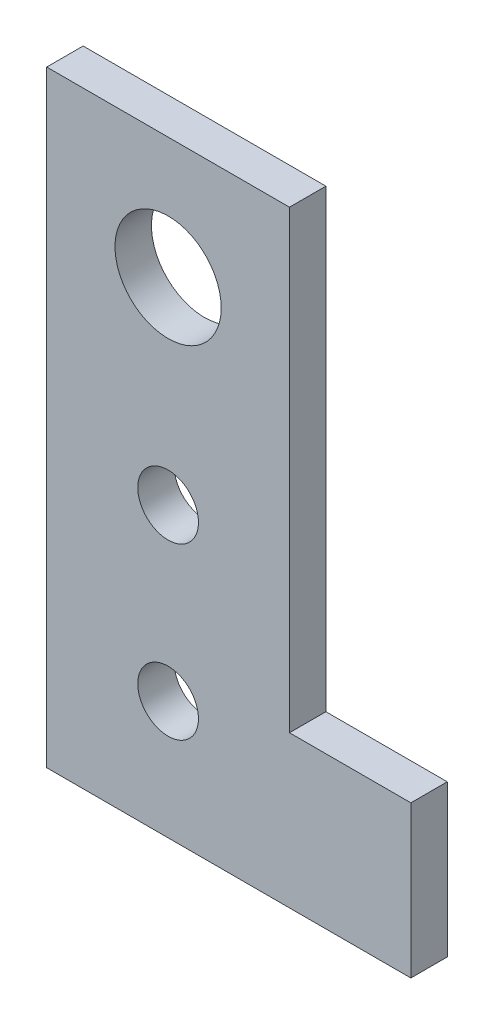
ISO-10303-21;
HEADER;
FILE_DESCRIPTION(('STEP AP214'),'2;1');
FILE_NAME('part.step','',(''),(''),'','','');
FILE_SCHEMA(('AUTOMOTIVE_DESIGN { 1 0 10303 214 1 1 1 1 }'));
ENDSEC;
DATA;
#1=APPLICATION_CONTEXT('core data for automotive mechanical design processes');
#2=APPLICATION_PROTOCOL_DEFINITION('international standard','automotive_design',2000,#1);
#3=PRODUCT_CONTEXT('',#1,'mechanical');
#4=PRODUCT('Part','Part','',(#3));
#5=PRODUCT_RELATED_PRODUCT_CATEGORY('part','',(#4));
#6=PRODUCT_DEFINITION_FORMATION('','',#4);
#7=PRODUCT_DEFINITION_CONTEXT('part definition',#1,'design');
#8=PRODUCT_DEFINITION('design','',#6,#7);
#9=PRODUCT_DEFINITION_SHAPE('','',#8);
#10=(LENGTH_UNIT() NAMED_UNIT(*) SI_UNIT(.MILLI.,.METRE.));
#11=(NAMED_UNIT(*) PLANE_ANGLE_UNIT() SI_UNIT($,.RADIAN.));
#12=(NAMED_UNIT(*) SI_UNIT($,.STERADIAN.) SOLID_ANGLE_UNIT());
#13=UNCERTAINTY_MEASURE_WITH_UNIT(LENGTH_MEASURE(1.E-05),#10,'distance_accuracy_value','');
#14=(GEOMETRIC_REPRESENTATION_CONTEXT(3) GLOBAL_UNCERTAINTY_ASSIGNED_CONTEXT((#13)) GLOBAL_UNIT_ASSIGNED_CONTEXT((#10,
#11,#12)) REPRESENTATION_CONTEXT('',''));
#15=CARTESIAN_POINT('',(0.,0.,0.));
#16=DIRECTION('',(0.,0.,1.));
#17=DIRECTION('',(1.,0.,0.));
#18=AXIS2_PLACEMENT_3D('',#15,#16,#17);
#19=CARTESIAN_POINT('',(0.,0.,-1.2));
#20=DIRECTION('',(-1.,0.,0.));
#21=DIRECTION('',(0.,-1.,0.));
#22=AXIS2_PLACEMENT_3D('',#19,#20,#21);
#23=PLANE('',#22);
#24=DIRECTION('',(0.,-1.,0.));
#25=VECTOR('',#24,1.);
#26=CARTESIAN_POINT('',(0.,0.,0.));
#27=LINE('',#26,#25);
#28=CARTESIAN_POINT('',(0.,20.,0.));
#29=VERTEX_POINT('',#28);
#30=CARTESIAN_POINT('',(0.,0.,0.));
#31=VERTEX_POINT('',#30);
#32=EDGE_CURVE('E124',#29,#31,#27,.T.);
#33=ORIENTED_EDGE('',*,*,#32,.F.);
#34=DIRECTION('',(0.,0.,1.));
#35=VECTOR('',#34,1.);
#36=CARTESIAN_POINT('',(0.,20.,-1.2));
#37=LINE('',#36,#35);
#38=CARTESIAN_POINT('',(0.,20.,-1.2));
#39=VERTEX_POINT('',#38);
#40=EDGE_CURVE('E11',#39,#29,#37,.T.);
#41=ORIENTED_EDGE('',*,*,#40,.F.);
#42=DIRECTION('',(0.,-1.,0.));
#43=VECTOR('',#42,1.);
#44=CARTESIAN_POINT('',(0.,0.,-1.2));
#45=LINE('',#44,#43);
#46=CARTESIAN_POINT('',(0.,0.,-1.2));
#47=VERTEX_POINT('',#46);
#48=EDGE_CURVE('E139',#39,#47,#45,.T.);
#49=ORIENTED_EDGE('',*,*,#48,.T.);
#50=DIRECTION('',(0.,0.,1.));
#51=VECTOR('',#50,1.);
#52=CARTESIAN_POINT('',(0.,0.,-1.2));
#53=LINE('',#52,#51);
#54=EDGE_CURVE('E42',#47,#31,#53,.T.);
#55=ORIENTED_EDGE('',*,*,#54,.T.);
#56=EDGE_LOOP('',(#33,#41,#49,#55));
#57=FACE_BOUND('',#56,.T.);
#58=ADVANCED_FACE('F39',(#57),#23,.T.);
#59=CARTESIAN_POINT('',(0.,20.,-1.2));
#60=DIRECTION('',(0.,1.,0.));
#61=DIRECTION('',(-1.,0.,0.));
#62=AXIS2_PLACEMENT_3D('',#59,#60,#61);
#63=PLANE('',#62);
#64=DIRECTION('',(-1.,0.,0.));
#65=VECTOR('',#64,1.);
#66=CARTESIAN_POINT('',(0.,20.,0.));
#67=LINE('',#66,#65);
#68=CARTESIAN_POINT('',(8.00000000000001,20.,0.));
#69=VERTEX_POINT('',#68);
#70=EDGE_CURVE('E137',#69,#29,#67,.T.);
#71=ORIENTED_EDGE('',*,*,#70,.F.);
#72=DIRECTION('',(0.,0.,1.));
#73=VECTOR('',#72,1.);
#74=CARTESIAN_POINT('',(8.00000000000001,20.,-1.2));
#75=LINE('',#74,#73);
#76=CARTESIAN_POINT('',(8.00000000000001,20.,-1.2));
#77=VERTEX_POINT('',#76);
#78=EDGE_CURVE('E48',#77,#69,#75,.T.);
#79=ORIENTED_EDGE('',*,*,#78,.F.);
#80=DIRECTION('',(-1.,0.,0.));
#81=VECTOR('',#80,1.);
#82=CARTESIAN_POINT('',(0.,20.,-1.2));
#83=LINE('',#82,#81);
#84=EDGE_CURVE('E114',#77,#39,#83,.T.);
#85=ORIENTED_EDGE('',*,*,#84,.T.);
#86=ORIENTED_EDGE('',*,*,#40,.T.);
#87=EDGE_LOOP('',(#71,#79,#85,#86));
#88=FACE_BOUND('',#87,.T.);
#89=ADVANCED_FACE('F147',(#88),#63,.T.);
#90=CARTESIAN_POINT('',(8.00000000000002,5.,-1.2));
#91=DIRECTION('',(1.,0.,0.));
#92=DIRECTION('',(0.,1.,0.));
#93=AXIS2_PLACEMENT_3D('',#90,#91,#92);
#94=PLANE('',#93);
#95=DIRECTION('',(0.,1.,0.));
#96=VECTOR('',#95,1.);
#97=CARTESIAN_POINT('',(8.00000000000002,5.,0.));
#98=LINE('',#97,#96);
#99=CARTESIAN_POINT('',(8.00000000000002,5.,0.));
#100=VERTEX_POINT('',#99);
#101=EDGE_CURVE('E101',#100,#69,#98,.T.);
#102=ORIENTED_EDGE('',*,*,#101,.F.);
#103=DIRECTION('',(0.,0.,1.));
#104=VECTOR('',#103,1.);
#105=CARTESIAN_POINT('',(8.00000000000002,5.,-1.2));
#106=LINE('',#105,#104);
#107=CARTESIAN_POINT('',(8.00000000000002,5.,-1.2));
#108=VERTEX_POINT('',#107);
#109=EDGE_CURVE('E96',#108,#100,#106,.T.);
#110=ORIENTED_EDGE('',*,*,#109,.F.);
#111=DIRECTION('',(0.,1.,0.));
#112=VECTOR('',#111,1.);
#113=CARTESIAN_POINT('',(8.00000000000002,5.,-1.2));
#114=LINE('',#113,#112);
#115=EDGE_CURVE('E99',#108,#77,#114,.T.);
#116=ORIENTED_EDGE('',*,*,#115,.T.);
#117=ORIENTED_EDGE('',*,*,#78,.T.);
#118=EDGE_LOOP('',(#102,#110,#116,#117));
#119=FACE_BOUND('',#118,.T.);
#120=ADVANCED_FACE('F98',(#119),#94,.T.);
#121=CARTESIAN_POINT('',(8.00000000000002,5.,-1.2));
#122=DIRECTION('',(0.,1.,0.));
#123=DIRECTION('',(0.,0.,1.));
#124=AXIS2_PLACEMENT_3D('',#121,#122,#123);
#125=PLANE('',#124);
#126=DIRECTION('',(-1.,0.,0.));
#127=VECTOR('',#126,1.);
#128=CARTESIAN_POINT('',(8.00000000000002,5.,0.));
#129=LINE('',#128,#127);
#130=CARTESIAN_POINT('',(12.,5.,0.));
#131=VERTEX_POINT('',#130);
#132=EDGE_CURVE('E134',#131,#100,#129,.T.);
#133=ORIENTED_EDGE('',*,*,#132,.F.);
#134=DIRECTION('',(0.,0.,1.));
#135=VECTOR('',#134,1.);
#136=CARTESIAN_POINT('',(12.,5.,-1.2));
#137=LINE('',#136,#135);
#138=CARTESIAN_POINT('',(12.,5.,-1.2));
#139=VERTEX_POINT('',#138);
#140=EDGE_CURVE('E106',#139,#131,#137,.T.);
#141=ORIENTED_EDGE('',*,*,#140,.F.);
#142=DIRECTION('',(-1.,0.,0.));
#143=VECTOR('',#142,1.);
#144=CARTESIAN_POINT('',(8.00000000000002,5.,-1.2));
#145=LINE('',#144,#143);
#146=EDGE_CURVE('E112',#139,#108,#145,.T.);
#147=ORIENTED_EDGE('',*,*,#146,.T.);
#148=ORIENTED_EDGE('',*,*,#109,.T.);
#149=EDGE_LOOP('',(#133,#141,#147,#148));
#150=FACE_BOUND('',#149,.T.);
#151=ADVANCED_FACE('F116',(#150),#125,.T.);
#152=CARTESIAN_POINT('',(12.,0.,-1.2));
#153=DIRECTION('',(1.,0.,0.));
#154=DIRECTION('',(0.,0.,-1.));
#155=AXIS2_PLACEMENT_3D('',#152,#153,#154);
#156=PLANE('',#155);
#157=DIRECTION('',(0.,1.,0.));
#158=VECTOR('',#157,1.);
#159=CARTESIAN_POINT('',(12.,0.,0.));
#160=LINE('',#159,#158);
#161=CARTESIAN_POINT('',(12.,0.,0.));
#162=VERTEX_POINT('',#161);
#163=EDGE_CURVE('E131',#162,#131,#160,.T.);
#164=ORIENTED_EDGE('',*,*,#163,.F.);
#165=DIRECTION('',(0.,0.,1.));
#166=VECTOR('',#165,1.);
#167=CARTESIAN_POINT('',(12.,0.,-1.2));
#168=LINE('',#167,#166);
#169=CARTESIAN_POINT('',(12.,0.,-1.2));
#170=VERTEX_POINT('',#169);
#171=EDGE_CURVE('E142',#170,#162,#168,.T.);
#172=ORIENTED_EDGE('',*,*,#171,.F.);
#173=DIRECTION('',(0.,1.,0.));
#174=VECTOR('',#173,1.);
#175=CARTESIAN_POINT('',(12.,0.,-1.2));
#176=LINE('',#175,#174);
#177=EDGE_CURVE('E117',#170,#139,#176,.T.);
#178=ORIENTED_EDGE('',*,*,#177,.T.);
#179=ORIENTED_EDGE('',*,*,#140,.T.);
#180=EDGE_LOOP('',(#164,#172,#178,#179));
#181=FACE_BOUND('',#180,.T.);
#182=ADVANCED_FACE('F160',(#181),#156,.T.);
#183=CARTESIAN_POINT('',(0.,0.,-1.2));
#184=DIRECTION('',(0.,-1.,0.));
#185=DIRECTION('',(0.,0.,-1.));
#186=AXIS2_PLACEMENT_3D('',#183,#184,#185);
#187=PLANE('',#186);
#188=DIRECTION('',(1.,0.,0.));
#189=VECTOR('',#188,1.);
#190=CARTESIAN_POINT('',(0.,0.,0.));
#191=LINE('',#190,#189);
#192=EDGE_CURVE('E127',#31,#162,#191,.T.);
#193=ORIENTED_EDGE('',*,*,#192,.F.);
#194=ORIENTED_EDGE('',*,*,#54,.F.);
#195=DIRECTION('',(1.,0.,0.));
#196=VECTOR('',#195,1.);
#197=CARTESIAN_POINT('',(0.,0.,-1.2));
#198=LINE('',#197,#196);
#199=EDGE_CURVE('E119',#47,#170,#198,.T.);
#200=ORIENTED_EDGE('',*,*,#199,.T.);
#201=ORIENTED_EDGE('',*,*,#171,.T.);
#202=EDGE_LOOP('',(#193,#194,#200,#201));
#203=FACE_BOUND('',#202,.T.);
#204=ADVANCED_FACE('F144',(#203),#187,.T.);
#205=CARTESIAN_POINT('',(0.,0.,-1.2));
#206=DIRECTION('',(0.,0.,-1.));
#207=DIRECTION('',(-1.,0.,0.));
#208=AXIS2_PLACEMENT_3D('',#205,#206,#207);
#209=PLANE('',#208);
#210=CARTESIAN_POINT('',(4.00000000000001,3.9,-1.2));
#211=DIRECTION('',(0.,0.,1.));
#212=DIRECTION('',(1.,0.,0.));
#213=AXIS2_PLACEMENT_3D('',#210,#211,#212);
#214=CIRCLE('',#213,1.);
#215=CARTESIAN_POINT('',(5.00000000000001,3.9,-1.2));
#216=VERTEX_POINT('',#215);
#217=EDGE_CURVE('E190',#216,#216,#214,.T.);
#218=ORIENTED_EDGE('',*,*,#217,.T.);
#219=EDGE_LOOP('',(#218));
#220=FACE_BOUND('',#219,.T.);
#221=CARTESIAN_POINT('',(4.00000000000001,9.5,-1.2));
#222=DIRECTION('',(0.,0.,1.));
#223=DIRECTION('',(1.,0.,0.));
#224=AXIS2_PLACEMENT_3D('',#221,#222,#223);
#225=CIRCLE('',#224,1.);
#226=CARTESIAN_POINT('',(5.00000000000001,9.5,-1.2));
#227=VERTEX_POINT('',#226);
#228=EDGE_CURVE('E198',#227,#227,#225,.T.);
#229=ORIENTED_EDGE('',*,*,#228,.T.);
#230=EDGE_LOOP('',(#229));
#231=FACE_BOUND('',#230,.T.);
#232=CARTESIAN_POINT('',(4.00000000000001,16.,-1.2));
#233=DIRECTION('',(0.,0.,1.));
#234=DIRECTION('',(1.,0.,0.));
#235=AXIS2_PLACEMENT_3D('',#232,#233,#234);
#236=CIRCLE('',#235,1.75);
#237=CARTESIAN_POINT('',(5.75000000000001,16.,-1.2));
#238=VERTEX_POINT('',#237);
#239=EDGE_CURVE('E128',#238,#238,#236,.T.);
#240=ORIENTED_EDGE('',*,*,#239,.T.);
#241=EDGE_LOOP('',(#240));
#242=FACE_BOUND('',#241,.T.);
#243=ORIENTED_EDGE('',*,*,#48,.F.);
#244=ORIENTED_EDGE('',*,*,#84,.F.);
#245=ORIENTED_EDGE('',*,*,#115,.F.);
#246=ORIENTED_EDGE('',*,*,#146,.F.);
#247=ORIENTED_EDGE('',*,*,#177,.F.);
#248=ORIENTED_EDGE('',*,*,#199,.F.);
#249=EDGE_LOOP('',(#243,#244,#245,#246,#247,#248));
#250=FACE_BOUND('',#249,.T.);
#251=ADVANCED_FACE('F110',(#220,#231,#242,#250),#209,.T.);
#252=CARTESIAN_POINT('',(0.,0.,0.));
#253=DIRECTION('',(0.,0.,-1.));
#254=DIRECTION('',(-1.,0.,0.));
#255=AXIS2_PLACEMENT_3D('',#252,#253,#254);
#256=PLANE('',#255);
#257=CARTESIAN_POINT('',(4.00000000000001,3.9,0.));
#258=DIRECTION('',(0.,0.,1.));
#259=DIRECTION('',(1.,0.,0.));
#260=AXIS2_PLACEMENT_3D('',#257,#258,#259);
#261=CIRCLE('',#260,1.);
#262=CARTESIAN_POINT('',(5.00000000000001,3.9,0.));
#263=VERTEX_POINT('',#262);
#264=EDGE_CURVE('E193',#263,#263,#261,.T.);
#265=ORIENTED_EDGE('',*,*,#264,.F.);
#266=EDGE_LOOP('',(#265));
#267=FACE_BOUND('',#266,.T.);
#268=CARTESIAN_POINT('',(4.00000000000001,9.5,0.));
#269=DIRECTION('',(0.,0.,1.));
#270=DIRECTION('',(1.,0.,0.));
#271=AXIS2_PLACEMENT_3D('',#268,#269,#270);
#272=CIRCLE('',#271,1.);
#273=CARTESIAN_POINT('',(5.00000000000001,9.5,0.));
#274=VERTEX_POINT('',#273);
#275=EDGE_CURVE('E195',#274,#274,#272,.T.);
#276=ORIENTED_EDGE('',*,*,#275,.F.);
#277=EDGE_LOOP('',(#276));
#278=FACE_BOUND('',#277,.T.);
#279=CARTESIAN_POINT('',(4.00000000000001,16.,0.));
#280=DIRECTION('',(0.,0.,1.));
#281=DIRECTION('',(1.,0.,0.));
#282=AXIS2_PLACEMENT_3D('',#279,#280,#281);
#283=CIRCLE('',#282,1.75);
#284=CARTESIAN_POINT('',(5.75000000000001,16.,0.));
#285=VERTEX_POINT('',#284);
#286=EDGE_CURVE('E201',#285,#285,#283,.T.);
#287=ORIENTED_EDGE('',*,*,#286,.F.);
#288=EDGE_LOOP('',(#287));
#289=FACE_BOUND('',#288,.T.);
#290=ORIENTED_EDGE('',*,*,#32,.T.);
#291=ORIENTED_EDGE('',*,*,#192,.T.);
#292=ORIENTED_EDGE('',*,*,#163,.T.);
#293=ORIENTED_EDGE('',*,*,#132,.T.);
#294=ORIENTED_EDGE('',*,*,#101,.T.);
#295=ORIENTED_EDGE('',*,*,#70,.T.);
#296=EDGE_LOOP('',(#290,#291,#292,#293,#294,#295));
#297=FACE_BOUND('',#296,.T.);
#298=ADVANCED_FACE('F146',(#267,#278,#289,#297),#256,.F.);
#299=CARTESIAN_POINT('',(4.00000000000001,16.,-1.2));
#300=DIRECTION('',(0.,0.,1.));
#301=DIRECTION('',(1.,0.,0.));
#302=AXIS2_PLACEMENT_3D('',#299,#300,#301);
#303=CYLINDRICAL_SURFACE('',#302,1.75);
#304=ORIENTED_EDGE('',*,*,#239,.F.);
#305=EDGE_LOOP('',(#304));
#306=FACE_BOUND('',#305,.T.);
#307=ORIENTED_EDGE('',*,*,#286,.T.);
#308=EDGE_LOOP('',(#307));
#309=FACE_BOUND('',#308,.T.);
#310=ADVANCED_FACE('F171',(#306,#309),#303,.F.);
#311=CARTESIAN_POINT('',(4.00000000000001,9.5,-1.2));
#312=DIRECTION('',(0.,0.,1.));
#313=DIRECTION('',(1.,0.,0.));
#314=AXIS2_PLACEMENT_3D('',#311,#312,#313);
#315=CYLINDRICAL_SURFACE('',#314,1.);
#316=ORIENTED_EDGE('',*,*,#228,.F.);
#317=EDGE_LOOP('',(#316));
#318=FACE_BOUND('',#317,.T.);
#319=ORIENTED_EDGE('',*,*,#275,.T.);
#320=EDGE_LOOP('',(#319));
#321=FACE_BOUND('',#320,.T.);
#322=ADVANCED_FACE('F178',(#318,#321),#315,.F.);
#323=CARTESIAN_POINT('',(4.00000000000001,3.9,-1.2));
#324=DIRECTION('',(0.,0.,1.));
#325=DIRECTION('',(1.,0.,0.));
#326=AXIS2_PLACEMENT_3D('',#323,#324,#325);
#327=CYLINDRICAL_SURFACE('',#326,1.);
#328=ORIENTED_EDGE('',*,*,#217,.F.);
#329=EDGE_LOOP('',(#328));
#330=FACE_BOUND('',#329,.T.);
#331=ORIENTED_EDGE('',*,*,#264,.T.);
#332=EDGE_LOOP('',(#331));
#333=FACE_BOUND('',#332,.T.);
#334=ADVANCED_FACE('F182',(#330,#333),#327,.F.);
#335=CLOSED_SHELL('',(#58,#89,#120,#151,#182,#204,#251,#298,#310,#322,#334));
#336=MANIFOLD_SOLID_BREP('B2',#335);
#337=ADVANCED_BREP_SHAPE_REPRESENTATION('',(#18,#336),#14);
#338=SHAPE_DEFINITION_REPRESENTATION(#9,#337);
ENDSEC;
END-ISO-10303-21;
